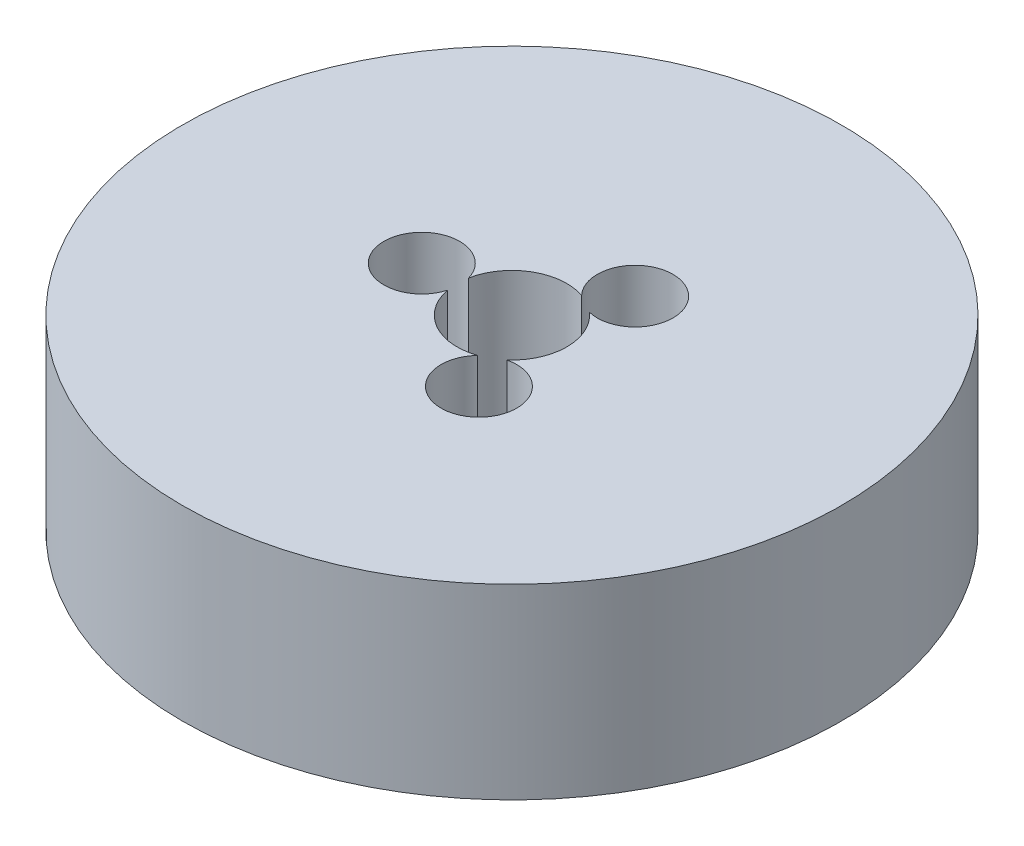
ISO-10303-21;
HEADER;
FILE_DESCRIPTION(('STEP AP214'),'2;1');
FILE_NAME('part.step','',(''),(''),'','','');
FILE_SCHEMA(('AUTOMOTIVE_DESIGN { 1 0 10303 214 1 1 1 1 }'));
ENDSEC;
DATA;
#1=APPLICATION_CONTEXT('core data for automotive mechanical design processes');
#2=APPLICATION_PROTOCOL_DEFINITION('international standard','automotive_design',2000,#1);
#3=PRODUCT_CONTEXT('',#1,'mechanical');
#4=PRODUCT('Part','Part','',(#3));
#5=PRODUCT_RELATED_PRODUCT_CATEGORY('part','',(#4));
#6=PRODUCT_DEFINITION_FORMATION('','',#4);
#7=PRODUCT_DEFINITION_CONTEXT('part definition',#1,'design');
#8=PRODUCT_DEFINITION('design','',#6,#7);
#9=PRODUCT_DEFINITION_SHAPE('','',#8);
#10=(LENGTH_UNIT() NAMED_UNIT(*) SI_UNIT(.MILLI.,.METRE.));
#11=(NAMED_UNIT(*) PLANE_ANGLE_UNIT() SI_UNIT($,.RADIAN.));
#12=(NAMED_UNIT(*) SI_UNIT($,.STERADIAN.) SOLID_ANGLE_UNIT());
#13=UNCERTAINTY_MEASURE_WITH_UNIT(LENGTH_MEASURE(1.E-05),#10,'distance_accuracy_value','');
#14=(GEOMETRIC_REPRESENTATION_CONTEXT(3) GLOBAL_UNCERTAINTY_ASSIGNED_CONTEXT((#13)) GLOBAL_UNIT_ASSIGNED_CONTEXT((#10,
#11,#12)) REPRESENTATION_CONTEXT('',''));
#15=CARTESIAN_POINT('',(0.,0.,0.));
#16=DIRECTION('',(0.,0.,1.));
#17=DIRECTION('',(1.,0.,0.));
#18=AXIS2_PLACEMENT_3D('',#15,#16,#17);
#19=CARTESIAN_POINT('',(0.,17.,0.));
#20=DIRECTION('',(0.,-1.,0.));
#21=DIRECTION('',(0.,0.,-1.));
#22=AXIS2_PLACEMENT_3D('',#19,#20,#21);
#23=CYLINDRICAL_SURFACE('',#22,30.);
#24=CARTESIAN_POINT('',(0.,17.,0.));
#25=DIRECTION('',(0.,1.,0.));
#26=DIRECTION('',(0.,0.,1.));
#27=AXIS2_PLACEMENT_3D('',#24,#25,#26);
#28=CIRCLE('',#27,30.);
#29=CARTESIAN_POINT('',(0.,17.,30.));
#30=VERTEX_POINT('',#29);
#31=EDGE_CURVE('E126',#30,#30,#28,.T.);
#32=ORIENTED_EDGE('',*,*,#31,.F.);
#33=EDGE_LOOP('',(#32));
#34=FACE_BOUND('',#33,.T.);
#35=CARTESIAN_POINT('',(0.,0.,0.));
#36=DIRECTION('',(0.,1.,0.));
#37=DIRECTION('',(0.,0.,1.));
#38=AXIS2_PLACEMENT_3D('',#35,#36,#37);
#39=CIRCLE('',#38,30.);
#40=CARTESIAN_POINT('',(0.,0.,30.));
#41=VERTEX_POINT('',#40);
#42=EDGE_CURVE('E124',#41,#41,#39,.T.);
#43=ORIENTED_EDGE('',*,*,#42,.T.);
#44=EDGE_LOOP('',(#43));
#45=FACE_BOUND('',#44,.T.);
#46=ADVANCED_FACE('F39',(#34,#45),#23,.T.);
#47=CARTESIAN_POINT('',(0.,17.,0.));
#48=DIRECTION('',(0.,1.,0.));
#49=DIRECTION('',(0.,0.,1.));
#50=AXIS2_PLACEMENT_3D('',#47,#48,#49);
#51=PLANE('',#50);
#52=CARTESIAN_POINT('',(4.10500258181537,17.,7.11007303690556));
#53=DIRECTION('',(0.,1.,0.));
#54=DIRECTION('',(0.866025403784436,0.,-0.500000000000004));
#55=AXIS2_PLACEMENT_3D('',#52,#53,#54);
#56=CIRCLE('',#55,3.44508294745144);
#57=CARTESIAN_POINT('',(1.61106712216401,17.,4.733335264682));
#58=VERTEX_POINT('',#57);
#59=CARTESIAN_POINT('',(3.29365502276138,17.,3.76189268733688));
#60=VERTEX_POINT('',#59);
#61=EDGE_CURVE('E147',#58,#60,#56,.T.);
#62=ORIENTED_EDGE('',*,*,#61,.F.);
#63=CARTESIAN_POINT('',(0.,17.,0.));
#64=DIRECTION('',(0.,1.,0.));
#65=DIRECTION('',(0.,0.,1.));
#66=AXIS2_PLACEMENT_3D('',#63,#64,#65);
#67=CIRCLE('',#66,5.);
#68=CARTESIAN_POINT('',(-4.90472214492535,17.,0.971442577345107));
#69=VERTEX_POINT('',#68);
#70=EDGE_CURVE('E118',#69,#58,#67,.T.);
#71=ORIENTED_EDGE('',*,*,#70,.F.);
#72=CARTESIAN_POINT('',(-8.21000516363067,17.,0.));
#73=DIRECTION('',(0.,1.,0.));
#74=DIRECTION('',(0.,0.,1.));
#75=AXIS2_PLACEMENT_3D('',#72,#73,#74);
#76=CIRCLE('',#75,3.44508294745144);
#77=CARTESIAN_POINT('',(-4.90472214492535,17.,-0.971442577345107));
#78=VERTEX_POINT('',#77);
#79=EDGE_CURVE('E113',#78,#69,#76,.T.);
#80=ORIENTED_EDGE('',*,*,#79,.F.);
#81=CARTESIAN_POINT('',(1.61106712216394,17.,-4.73333526468202));
#82=VERTEX_POINT('',#81);
#83=EDGE_CURVE('E106',#82,#78,#67,.T.);
#84=ORIENTED_EDGE('',*,*,#83,.F.);
#85=CARTESIAN_POINT('',(4.10500258181527,17.,-7.11007303690562));
#86=DIRECTION('',(0.,1.,0.));
#87=DIRECTION('',(-0.866025403784443,0.,-0.499999999999992));
#88=AXIS2_PLACEMENT_3D('',#85,#86,#87);
#89=CIRCLE('',#88,3.44508294745144);
#90=CARTESIAN_POINT('',(3.29365502276133,17.,-3.76189268733693));
#91=VERTEX_POINT('',#90);
#92=EDGE_CURVE('E90',#91,#82,#89,.T.);
#93=ORIENTED_EDGE('',*,*,#92,.F.);
#94=EDGE_CURVE('E116',#60,#91,#67,.T.);
#95=ORIENTED_EDGE('',*,*,#94,.F.);
#96=EDGE_LOOP('',(#62,#71,#80,#84,#93,#95));
#97=FACE_BOUND('',#96,.T.);
#98=ORIENTED_EDGE('',*,*,#31,.T.);
#99=EDGE_LOOP('',(#98));
#100=FACE_BOUND('',#99,.T.);
#101=ADVANCED_FACE('F115',(#97,#100),#51,.T.);
#102=CARTESIAN_POINT('',(0.,0.,0.));
#103=DIRECTION('',(0.,1.,0.));
#104=DIRECTION('',(0.,0.,1.));
#105=AXIS2_PLACEMENT_3D('',#102,#103,#104);
#106=PLANE('',#105);
#107=CARTESIAN_POINT('',(0.,0.,0.));
#108=DIRECTION('',(0.,1.,0.));
#109=DIRECTION('',(0.,0.,1.));
#110=AXIS2_PLACEMENT_3D('',#107,#108,#109);
#111=CIRCLE('',#110,5.);
#112=CARTESIAN_POINT('',(0.,0.,5.));
#113=VERTEX_POINT('',#112);
#114=EDGE_CURVE('E120',#113,#113,#111,.T.);
#115=ORIENTED_EDGE('',*,*,#114,.T.);
#116=EDGE_LOOP('',(#115));
#117=FACE_BOUND('',#116,.T.);
#118=ORIENTED_EDGE('',*,*,#42,.F.);
#119=EDGE_LOOP('',(#118));
#120=FACE_BOUND('',#119,.T.);
#121=ADVANCED_FACE('F164',(#117,#120),#106,.F.);
#122=CARTESIAN_POINT('',(0.,17.,0.));
#123=DIRECTION('',(0.,-1.,0.));
#124=DIRECTION('',(0.,0.,-1.));
#125=AXIS2_PLACEMENT_3D('',#122,#123,#124);
#126=CYLINDRICAL_SURFACE('',#125,5.);
#127=DIRECTION('',(0.,1.,0.));
#128=VECTOR('',#127,1.);
#129=CARTESIAN_POINT('',(1.61106712216401,10.978932811018,4.73333526468199));
#130=LINE('',#129,#128);
#131=CARTESIAN_POINT('',(1.61106712216401,4.95786562203598,4.733335264682));
#132=VERTEX_POINT('',#131);
#133=EDGE_CURVE('E11',#132,#58,#130,.T.);
#134=ORIENTED_EDGE('',*,*,#133,.F.);
#135=CARTESIAN_POINT('',(0.,4.95786562203598,0.));
#136=DIRECTION('',(0.,1.,0.));
#137=DIRECTION('',(0.,0.,1.));
#138=AXIS2_PLACEMENT_3D('',#135,#136,#137);
#139=CIRCLE('',#138,5.);
#140=CARTESIAN_POINT('',(3.29365502276138,4.95786562203598,3.76189268733688));
#141=VERTEX_POINT('',#140);
#142=EDGE_CURVE('E144',#132,#141,#139,.T.);
#143=ORIENTED_EDGE('',*,*,#142,.T.);
#144=DIRECTION('',(0.,1.,0.));
#145=VECTOR('',#144,1.);
#146=CARTESIAN_POINT('',(3.29365502276138,10.978932811018,3.76189268733689));
#147=LINE('',#146,#145);
#148=EDGE_CURVE('E46',#60,#141,#147,.F.);
#149=ORIENTED_EDGE('',*,*,#148,.F.);
#150=ORIENTED_EDGE('',*,*,#94,.T.);
#151=DIRECTION('',(0.,1.,0.));
#152=VECTOR('',#151,1.);
#153=CARTESIAN_POINT('',(3.29365502276133,10.978932811018,-3.76189268733693));
#154=LINE('',#153,#152);
#155=CARTESIAN_POINT('',(3.29365502276133,4.95786562203598,-3.76189268733693));
#156=VERTEX_POINT('',#155);
#157=EDGE_CURVE('E92',#156,#91,#154,.T.);
#158=ORIENTED_EDGE('',*,*,#157,.F.);
#159=CARTESIAN_POINT('',(0.,4.95786562203598,0.));
#160=DIRECTION('',(0.,1.,0.));
#161=DIRECTION('',(0.,0.,1.));
#162=AXIS2_PLACEMENT_3D('',#159,#160,#161);
#163=CIRCLE('',#162,5.);
#164=CARTESIAN_POINT('',(1.61106712216394,4.95786562203598,-4.73333526468202));
#165=VERTEX_POINT('',#164);
#166=EDGE_CURVE('E107',#156,#165,#163,.T.);
#167=ORIENTED_EDGE('',*,*,#166,.T.);
#168=DIRECTION('',(0.,1.,0.));
#169=VECTOR('',#168,1.);
#170=CARTESIAN_POINT('',(1.61106712216394,10.978932811018,-4.73333526468202));
#171=LINE('',#170,#169);
#172=EDGE_CURVE('E95',#82,#165,#171,.F.);
#173=ORIENTED_EDGE('',*,*,#172,.F.);
#174=ORIENTED_EDGE('',*,*,#83,.T.);
#175=DIRECTION('',(0.,1.,0.));
#176=VECTOR('',#175,1.);
#177=CARTESIAN_POINT('',(-4.90472214492535,10.978932811018,-0.971442577345107));
#178=LINE('',#177,#176);
#179=CARTESIAN_POINT('',(-4.90472214492535,4.95786562203598,-0.971442577345107));
#180=VERTEX_POINT('',#179);
#181=EDGE_CURVE('E143',#180,#78,#178,.T.);
#182=ORIENTED_EDGE('',*,*,#181,.F.);
#183=CARTESIAN_POINT('',(0.,4.95786562203598,0.));
#184=DIRECTION('',(0.,1.,0.));
#185=DIRECTION('',(0.,0.,1.));
#186=AXIS2_PLACEMENT_3D('',#183,#184,#185);
#187=CIRCLE('',#186,5.);
#188=CARTESIAN_POINT('',(-4.90472214492535,4.95786562203598,0.971442577345107));
#189=VERTEX_POINT('',#188);
#190=EDGE_CURVE('E132',#180,#189,#187,.T.);
#191=ORIENTED_EDGE('',*,*,#190,.T.);
#192=DIRECTION('',(0.,1.,0.));
#193=VECTOR('',#192,1.);
#194=CARTESIAN_POINT('',(-4.90472214492535,10.978932811018,0.971442577345107));
#195=LINE('',#194,#193);
#196=EDGE_CURVE('E137',#69,#189,#195,.F.);
#197=ORIENTED_EDGE('',*,*,#196,.F.);
#198=ORIENTED_EDGE('',*,*,#70,.T.);
#199=EDGE_LOOP('',(#134,#143,#149,#150,#158,#167,#173,#174,#182,#191,#197,#198));
#200=FACE_BOUND('',#199,.T.);
#201=ORIENTED_EDGE('',*,*,#114,.F.);
#202=EDGE_LOOP('',(#201));
#203=FACE_BOUND('',#202,.T.);
#204=ADVANCED_FACE('F103',(#200,#203),#126,.F.);
#205=CARTESIAN_POINT('',(-8.21000516363067,4.95786562203598,0.));
#206=DIRECTION('',(0.,1.,0.));
#207=DIRECTION('',(0.,0.,1.));
#208=AXIS2_PLACEMENT_3D('',#205,#206,#207);
#209=CYLINDRICAL_SURFACE('',#208,3.44508294745144);
#210=ORIENTED_EDGE('',*,*,#181,.T.);
#211=ORIENTED_EDGE('',*,*,#79,.T.);
#212=ORIENTED_EDGE('',*,*,#196,.T.);
#213=CARTESIAN_POINT('',(-8.21000516363067,4.95786562203598,0.));
#214=DIRECTION('',(0.,1.,0.));
#215=DIRECTION('',(0.,0.,1.));
#216=AXIS2_PLACEMENT_3D('',#213,#214,#215);
#217=CIRCLE('',#216,3.44508294745144);
#218=EDGE_CURVE('E121',#180,#189,#217,.T.);
#219=ORIENTED_EDGE('',*,*,#218,.F.);
#220=EDGE_LOOP('',(#210,#211,#212,#219));
#221=FACE_BOUND('',#220,.T.);
#222=ADVANCED_FACE('F174',(#221),#209,.F.);
#223=CARTESIAN_POINT('',(-8.21000516363067,4.95786562203598,0.));
#224=DIRECTION('',(0.,1.,0.));
#225=DIRECTION('',(0.,0.,1.));
#226=AXIS2_PLACEMENT_3D('',#223,#224,#225);
#227=PLANE('',#226);
#228=ORIENTED_EDGE('',*,*,#218,.T.);
#229=ORIENTED_EDGE('',*,*,#190,.F.);
#230=EDGE_LOOP('',(#228,#229));
#231=FACE_BOUND('',#230,.T.);
#232=ADVANCED_FACE('F177',(#231),#227,.T.);
#233=CARTESIAN_POINT('',(4.10500258181527,4.95786562203598,-7.11007303690562));
#234=DIRECTION('',(0.,1.,0.));
#235=DIRECTION('',(0.,0.,1.));
#236=AXIS2_PLACEMENT_3D('',#233,#234,#235);
#237=CYLINDRICAL_SURFACE('',#236,3.44508294745144);
#238=ORIENTED_EDGE('',*,*,#157,.T.);
#239=ORIENTED_EDGE('',*,*,#92,.T.);
#240=ORIENTED_EDGE('',*,*,#172,.T.);
#241=CARTESIAN_POINT('',(4.10500258181527,4.95786562203598,-7.11007303690562));
#242=DIRECTION('',(0.,1.,0.));
#243=DIRECTION('',(-0.866025403784443,0.,-0.499999999999992));
#244=AXIS2_PLACEMENT_3D('',#241,#242,#243);
#245=CIRCLE('',#244,3.44508294745144);
#246=EDGE_CURVE('E56',#156,#165,#245,.T.);
#247=ORIENTED_EDGE('',*,*,#246,.F.);
#248=EDGE_LOOP('',(#238,#239,#240,#247));
#249=FACE_BOUND('',#248,.T.);
#250=ADVANCED_FACE('F93',(#249),#237,.F.);
#251=CARTESIAN_POINT('',(4.10500258181527,4.95786562203598,-7.11007303690562));
#252=DIRECTION('',(0.,1.,0.));
#253=DIRECTION('',(-0.866025403784443,0.,-0.499999999999992));
#254=AXIS2_PLACEMENT_3D('',#251,#252,#253);
#255=PLANE('',#254);
#256=ORIENTED_EDGE('',*,*,#246,.T.);
#257=ORIENTED_EDGE('',*,*,#166,.F.);
#258=EDGE_LOOP('',(#256,#257));
#259=FACE_BOUND('',#258,.T.);
#260=ADVANCED_FACE('F160',(#259),#255,.T.);
#261=CARTESIAN_POINT('',(4.10500258181537,4.95786562203598,7.11007303690556));
#262=DIRECTION('',(0.,1.,0.));
#263=DIRECTION('',(0.,0.,1.));
#264=AXIS2_PLACEMENT_3D('',#261,#262,#263);
#265=CYLINDRICAL_SURFACE('',#264,3.44508294745144);
#266=ORIENTED_EDGE('',*,*,#133,.T.);
#267=ORIENTED_EDGE('',*,*,#61,.T.);
#268=ORIENTED_EDGE('',*,*,#148,.T.);
#269=CARTESIAN_POINT('',(4.10500258181537,4.95786562203598,7.11007303690556));
#270=DIRECTION('',(0.,1.,0.));
#271=DIRECTION('',(0.866025403784436,0.,-0.500000000000004));
#272=AXIS2_PLACEMENT_3D('',#269,#270,#271);
#273=CIRCLE('',#272,3.44508294745144);
#274=EDGE_CURVE('E55',#132,#141,#273,.T.);
#275=ORIENTED_EDGE('',*,*,#274,.F.);
#276=EDGE_LOOP('',(#266,#267,#268,#275));
#277=FACE_BOUND('',#276,.T.);
#278=ADVANCED_FACE('F149',(#277),#265,.F.);
#279=CARTESIAN_POINT('',(4.10500258181537,4.95786562203598,7.11007303690556));
#280=DIRECTION('',(0.,1.,0.));
#281=DIRECTION('',(0.866025403784436,0.,-0.500000000000004));
#282=AXIS2_PLACEMENT_3D('',#279,#280,#281);
#283=PLANE('',#282);
#284=ORIENTED_EDGE('',*,*,#274,.T.);
#285=ORIENTED_EDGE('',*,*,#142,.F.);
#286=EDGE_LOOP('',(#284,#285));
#287=FACE_BOUND('',#286,.T.);
#288=ADVANCED_FACE('F151',(#287),#283,.T.);
#289=CLOSED_SHELL('',(#46,#101,#121,#204,#222,#232,#250,#260,#278,#288));
#290=MANIFOLD_SOLID_BREP('B2',#289);
#291=ADVANCED_BREP_SHAPE_REPRESENTATION('',(#18,#290),#14);
#292=SHAPE_DEFINITION_REPRESENTATION(#9,#291);
ENDSEC;
END-ISO-10303-21;
